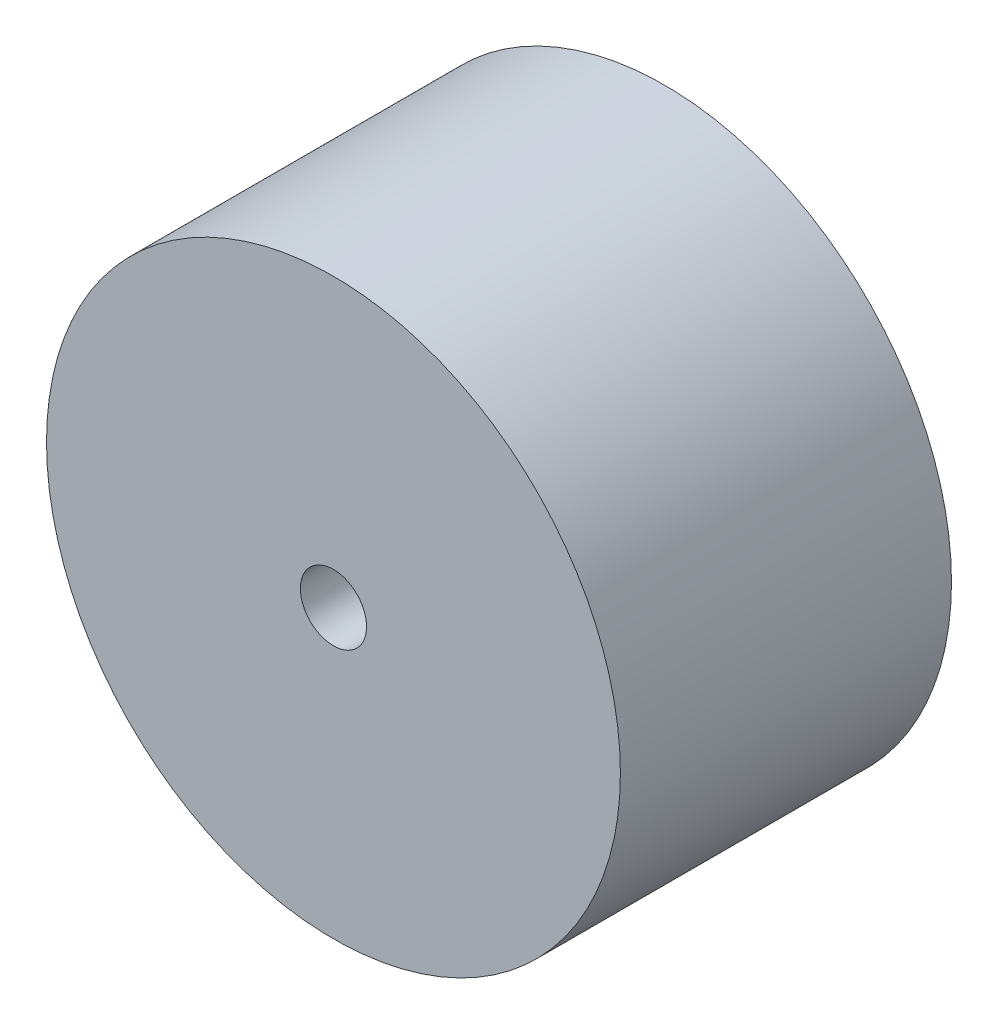
ISO-10303-21;
HEADER;
FILE_DESCRIPTION(('STEP AP214'),'2;1');
FILE_NAME('part.step','',(''),(''),'','','');
FILE_SCHEMA(('AUTOMOTIVE_DESIGN { 1 0 10303 214 1 1 1 1 }'));
ENDSEC;
DATA;
#1=APPLICATION_CONTEXT('core data for automotive mechanical design processes');
#2=APPLICATION_PROTOCOL_DEFINITION('international standard','automotive_design',2000,#1);
#3=PRODUCT_CONTEXT('',#1,'mechanical');
#4=PRODUCT('Part','Part','',(#3));
#5=PRODUCT_RELATED_PRODUCT_CATEGORY('part','',(#4));
#6=PRODUCT_DEFINITION_FORMATION('','',#4);
#7=PRODUCT_DEFINITION_CONTEXT('part definition',#1,'design');
#8=PRODUCT_DEFINITION('design','',#6,#7);
#9=PRODUCT_DEFINITION_SHAPE('','',#8);
#10=(LENGTH_UNIT() NAMED_UNIT(*) SI_UNIT(.MILLI.,.METRE.));
#11=(NAMED_UNIT(*) PLANE_ANGLE_UNIT() SI_UNIT($,.RADIAN.));
#12=(NAMED_UNIT(*) SI_UNIT($,.STERADIAN.) SOLID_ANGLE_UNIT());
#13=UNCERTAINTY_MEASURE_WITH_UNIT(LENGTH_MEASURE(1.E-05),#10,'distance_accuracy_value','');
#14=(GEOMETRIC_REPRESENTATION_CONTEXT(3) GLOBAL_UNCERTAINTY_ASSIGNED_CONTEXT((#13)) GLOBAL_UNIT_ASSIGNED_CONTEXT((#10,
#11,#12)) REPRESENTATION_CONTEXT('',''));
#15=CARTESIAN_POINT('',(0.,0.,0.));
#16=DIRECTION('',(0.,0.,1.));
#17=DIRECTION('',(1.,0.,0.));
#18=AXIS2_PLACEMENT_3D('',#15,#16,#17);
#19=CARTESIAN_POINT('',(0.,0.,30.));
#20=DIRECTION('',(0.,0.,-1.));
#21=DIRECTION('',(-1.,0.,0.));
#22=AXIS2_PLACEMENT_3D('',#19,#20,#21);
#23=CYLINDRICAL_SURFACE('',#22,3.);
#24=CARTESIAN_POINT('',(0.,0.,30.));
#25=DIRECTION('',(0.,0.,1.));
#26=DIRECTION('',(1.,0.,0.));
#27=AXIS2_PLACEMENT_3D('',#24,#25,#26);
#28=CIRCLE('',#27,3.);
#29=CARTESIAN_POINT('',(3.,0.,30.));
#30=VERTEX_POINT('',#29);
#31=EDGE_CURVE('E47',#30,#30,#28,.T.);
#32=ORIENTED_EDGE('',*,*,#31,.T.);
#33=EDGE_LOOP('',(#32));
#34=FACE_BOUND('',#33,.T.);
#35=CARTESIAN_POINT('',(0.,0.,0.));
#36=DIRECTION('',(0.,0.,1.));
#37=DIRECTION('',(1.,0.,0.));
#38=AXIS2_PLACEMENT_3D('',#35,#36,#37);
#39=CIRCLE('',#38,3.);
#40=CARTESIAN_POINT('',(3.,0.,0.));
#41=VERTEX_POINT('',#40);
#42=EDGE_CURVE('E54',#41,#41,#39,.T.);
#43=ORIENTED_EDGE('',*,*,#42,.F.);
#44=EDGE_LOOP('',(#43));
#45=FACE_BOUND('',#44,.T.);
#46=ADVANCED_FACE('F39',(#34,#45),#23,.F.);
#47=CARTESIAN_POINT('',(0.,0.,30.));
#48=DIRECTION('',(0.,0.,-1.));
#49=DIRECTION('',(-1.,0.,0.));
#50=AXIS2_PLACEMENT_3D('',#47,#48,#49);
#51=CYLINDRICAL_SURFACE('',#50,26.);
#52=CARTESIAN_POINT('',(0.,0.,30.));
#53=DIRECTION('',(0.,0.,1.));
#54=DIRECTION('',(1.,0.,0.));
#55=AXIS2_PLACEMENT_3D('',#52,#53,#54);
#56=CIRCLE('',#55,26.);
#57=CARTESIAN_POINT('',(26.,0.,30.));
#58=VERTEX_POINT('',#57);
#59=EDGE_CURVE('E10',#58,#58,#56,.T.);
#60=ORIENTED_EDGE('',*,*,#59,.F.);
#61=EDGE_LOOP('',(#60));
#62=FACE_BOUND('',#61,.T.);
#63=CARTESIAN_POINT('',(0.,0.,0.));
#64=DIRECTION('',(0.,0.,1.));
#65=DIRECTION('',(1.,0.,0.));
#66=AXIS2_PLACEMENT_3D('',#63,#64,#65);
#67=CIRCLE('',#66,26.);
#68=CARTESIAN_POINT('',(26.,0.,0.));
#69=VERTEX_POINT('',#68);
#70=EDGE_CURVE('E42',#69,#69,#67,.T.);
#71=ORIENTED_EDGE('',*,*,#70,.T.);
#72=EDGE_LOOP('',(#71));
#73=FACE_BOUND('',#72,.T.);
#74=ADVANCED_FACE('F63',(#62,#73),#51,.T.);
#75=CARTESIAN_POINT('',(0.,0.,30.));
#76=DIRECTION('',(0.,0.,1.));
#77=DIRECTION('',(1.,0.,0.));
#78=AXIS2_PLACEMENT_3D('',#75,#76,#77);
#79=PLANE('',#78);
#80=ORIENTED_EDGE('',*,*,#31,.F.);
#81=EDGE_LOOP('',(#80));
#82=FACE_BOUND('',#81,.T.);
#83=ORIENTED_EDGE('',*,*,#59,.T.);
#84=EDGE_LOOP('',(#83));
#85=FACE_BOUND('',#84,.T.);
#86=ADVANCED_FACE('F67',(#82,#85),#79,.T.);
#87=CARTESIAN_POINT('',(0.,0.,0.));
#88=DIRECTION('',(0.,0.,1.));
#89=DIRECTION('',(1.,0.,0.));
#90=AXIS2_PLACEMENT_3D('',#87,#88,#89);
#91=PLANE('',#90);
#92=ORIENTED_EDGE('',*,*,#42,.T.);
#93=EDGE_LOOP('',(#92));
#94=FACE_BOUND('',#93,.T.);
#95=ORIENTED_EDGE('',*,*,#70,.F.);
#96=EDGE_LOOP('',(#95));
#97=FACE_BOUND('',#96,.T.);
#98=ADVANCED_FACE('F65',(#94,#97),#91,.F.);
#99=CLOSED_SHELL('',(#46,#74,#86,#98));
#100=MANIFOLD_SOLID_BREP('B2',#99);
#101=ADVANCED_BREP_SHAPE_REPRESENTATION('',(#18,#100),#14);
#102=SHAPE_DEFINITION_REPRESENTATION(#9,#101);
ENDSEC;
END-ISO-10303-21;
